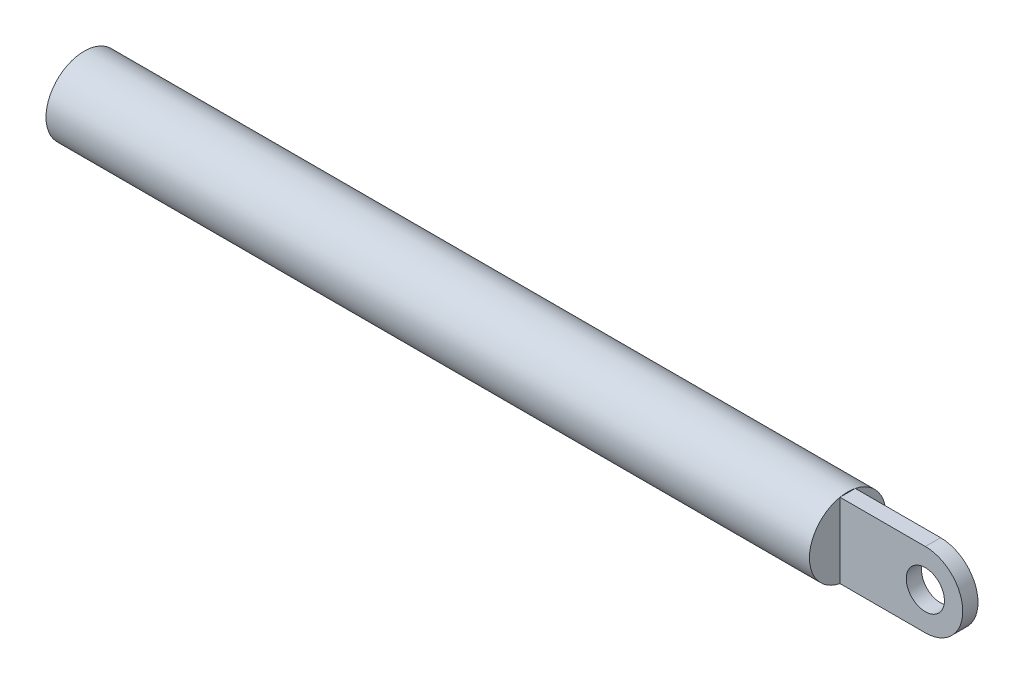
ISO-10303-21;
HEADER;
FILE_DESCRIPTION(('STEP AP214'),'2;1');
FILE_NAME('part.step','',(''),(''),'','','');
FILE_SCHEMA(('AUTOMOTIVE_DESIGN { 1 0 10303 214 1 1 1 1 }'));
ENDSEC;
DATA;
#1=APPLICATION_CONTEXT('core data for automotive mechanical design processes');
#2=APPLICATION_PROTOCOL_DEFINITION('international standard','automotive_design',2000,#1);
#3=PRODUCT_CONTEXT('',#1,'mechanical');
#4=PRODUCT('Part','Part','',(#3));
#5=PRODUCT_RELATED_PRODUCT_CATEGORY('part','',(#4));
#6=PRODUCT_DEFINITION_FORMATION('','',#4);
#7=PRODUCT_DEFINITION_CONTEXT('part definition',#1,'design');
#8=PRODUCT_DEFINITION('design','',#6,#7);
#9=PRODUCT_DEFINITION_SHAPE('','',#8);
#10=(LENGTH_UNIT() NAMED_UNIT(*) SI_UNIT(.MILLI.,.METRE.));
#11=(NAMED_UNIT(*) PLANE_ANGLE_UNIT() SI_UNIT($,.RADIAN.));
#12=(NAMED_UNIT(*) SI_UNIT($,.STERADIAN.) SOLID_ANGLE_UNIT());
#13=UNCERTAINTY_MEASURE_WITH_UNIT(LENGTH_MEASURE(1.E-05),#10,'distance_accuracy_value','');
#14=(GEOMETRIC_REPRESENTATION_CONTEXT(3) GLOBAL_UNCERTAINTY_ASSIGNED_CONTEXT((#13)) GLOBAL_UNIT_ASSIGNED_CONTEXT((#10,
#11,#12)) REPRESENTATION_CONTEXT('',''));
#15=CARTESIAN_POINT('',(0.,0.,0.));
#16=DIRECTION('',(0.,0.,1.));
#17=DIRECTION('',(1.,0.,0.));
#18=AXIS2_PLACEMENT_3D('',#15,#16,#17);
#19=CARTESIAN_POINT('',(46.1513157894737,8.93325735653892,0.));
#20=DIRECTION('',(0.,1.,0.));
#21=DIRECTION('',(0.,0.,1.));
#22=AXIS2_PLACEMENT_3D('',#19,#20,#21);
#23=PLANE('',#22);
#24=DIRECTION('',(0.,0.,1.));
#25=VECTOR('',#24,1.);
#26=CARTESIAN_POINT('',(37.3271390494249,8.93325735653892,-14.1858293307481));
#27=LINE('',#26,#25);
#28=CARTESIAN_POINT('',(37.3271390494249,8.93325735653892,-0.999999999999999));
#29=VERTEX_POINT('',#28);
#30=CARTESIAN_POINT('',(37.3271390494249,8.93325735653892,1.));
#31=VERTEX_POINT('',#30);
#32=EDGE_CURVE('E83',#29,#31,#27,.T.);
#33=ORIENTED_EDGE('',*,*,#32,.T.);
#34=DIRECTION('',(-1.,0.,0.));
#35=VECTOR('',#34,1.);
#36=CARTESIAN_POINT('',(46.1513157894737,8.93325735653892,1.00000000000003));
#37=LINE('',#36,#35);
#38=CARTESIAN_POINT('',(26.1513157894737,8.93325735653892,1.));
#39=VERTEX_POINT('',#38);
#40=EDGE_CURVE('E64',#31,#39,#37,.T.);
#41=ORIENTED_EDGE('',*,*,#40,.T.);
#42=DIRECTION('',(0.,0.,-1.));
#43=VECTOR('',#42,1.);
#44=CARTESIAN_POINT('',(26.1513157894737,8.93325735653892,0.));
#45=LINE('',#44,#43);
#46=CARTESIAN_POINT('',(26.1513157894737,8.93325735653892,-1.));
#47=VERTEX_POINT('',#46);
#48=EDGE_CURVE('E122',#39,#47,#45,.T.);
#49=ORIENTED_EDGE('',*,*,#48,.T.);
#50=DIRECTION('',(-1.,0.,0.));
#51=VECTOR('',#50,1.);
#52=CARTESIAN_POINT('',(46.1513157894737,8.93325735653892,-1.00000000000003));
#53=LINE('',#52,#51);
#54=EDGE_CURVE('E90',#29,#47,#53,.T.);
#55=ORIENTED_EDGE('',*,*,#54,.F.);
#56=EDGE_LOOP('',(#33,#41,#49,#55));
#57=FACE_BOUND('',#56,.T.);
#58=ADVANCED_FACE('F40',(#57),#23,.F.);
#59=CARTESIAN_POINT('',(46.1513157894737,18.7312163276716,0.));
#60=DIRECTION('',(0.,1.,0.));
#61=DIRECTION('',(0.,0.,1.));
#62=AXIS2_PLACEMENT_3D('',#59,#60,#61);
#63=PLANE('',#62);
#64=DIRECTION('',(-1.,0.,0.));
#65=VECTOR('',#64,1.);
#66=CARTESIAN_POINT('',(46.1513157894737,18.7312163276716,1.));
#67=LINE('',#66,#65);
#68=CARTESIAN_POINT('',(37.3271390494249,18.7312163276716,1.));
#69=VERTEX_POINT('',#68);
#70=CARTESIAN_POINT('',(26.1513157894737,18.7312163276716,1.00000000000001));
#71=VERTEX_POINT('',#70);
#72=EDGE_CURVE('E96',#69,#71,#67,.T.);
#73=ORIENTED_EDGE('',*,*,#72,.F.);
#74=DIRECTION('',(0.,0.,1.));
#75=VECTOR('',#74,1.);
#76=CARTESIAN_POINT('',(37.3271390494249,18.7312163276716,-14.1858293307481));
#77=LINE('',#76,#75);
#78=CARTESIAN_POINT('',(37.3271390494249,18.7312163276716,-0.999999999999999));
#79=VERTEX_POINT('',#78);
#80=EDGE_CURVE('E56',#79,#69,#77,.T.);
#81=ORIENTED_EDGE('',*,*,#80,.F.);
#82=DIRECTION('',(-1.,0.,0.));
#83=VECTOR('',#82,1.);
#84=CARTESIAN_POINT('',(46.1513157894737,18.7312163276716,-1.00000000000001));
#85=LINE('',#84,#83);
#86=CARTESIAN_POINT('',(26.1513157894737,18.7312163276716,-1.00000000000001));
#87=VERTEX_POINT('',#86);
#88=EDGE_CURVE('E98',#79,#87,#85,.T.);
#89=ORIENTED_EDGE('',*,*,#88,.T.);
#90=DIRECTION('',(0.,0.,-1.));
#91=VECTOR('',#90,1.);
#92=CARTESIAN_POINT('',(26.1513157894737,18.7312163276716,0.));
#93=LINE('',#92,#91);
#94=EDGE_CURVE('E100',#71,#87,#93,.T.);
#95=ORIENTED_EDGE('',*,*,#94,.F.);
#96=EDGE_LOOP('',(#73,#81,#89,#95));
#97=FACE_BOUND('',#96,.T.);
#98=ADVANCED_FACE('F141',(#97),#63,.T.);
#99=CARTESIAN_POINT('',(26.1513157894737,18.8322368421053,0.));
#100=DIRECTION('',(-1.,0.,0.));
#101=DIRECTION('',(0.,0.,1.));
#102=AXIS2_PLACEMENT_3D('',#99,#100,#101);
#103=PLANE('',#102);
#104=ORIENTED_EDGE('',*,*,#48,.F.);
#105=CARTESIAN_POINT('',(26.1513157894737,13.8322368421053,0.));
#106=DIRECTION('',(-1.,0.,0.));
#107=DIRECTION('',(0.,0.,1.));
#108=AXIS2_PLACEMENT_3D('',#105,#106,#107);
#109=CIRCLE('',#108,5.);
#110=EDGE_CURVE('E110',#47,#39,#109,.T.);
#111=ORIENTED_EDGE('',*,*,#110,.F.);
#112=EDGE_LOOP('',(#104,#111));
#113=FACE_BOUND('',#112,.T.);
#114=ADVANCED_FACE('F138',(#113),#103,.F.);
#115=EDGE_CURVE('E49',#39,#71,#109,.T.);
#116=ORIENTED_EDGE('',*,*,#115,.F.);
#117=DIRECTION('',(0.,1.,0.));
#118=VECTOR('',#117,1.);
#119=CARTESIAN_POINT('',(26.1513157894737,0.,1.));
#120=LINE('',#119,#118);
#121=EDGE_CURVE('E95',#39,#71,#120,.T.);
#122=ORIENTED_EDGE('',*,*,#121,.T.);
#123=EDGE_LOOP('',(#116,#122));
#124=FACE_BOUND('',#123,.T.);
#125=ADVANCED_FACE('F140',(#124),#103,.F.);
#126=DIRECTION('',(0.,1.,0.));
#127=VECTOR('',#126,1.);
#128=CARTESIAN_POINT('',(26.1513157894737,0.,-0.999999999999999));
#129=LINE('',#128,#127);
#130=EDGE_CURVE('E124',#47,#87,#129,.T.);
#131=ORIENTED_EDGE('',*,*,#130,.F.);
#132=EDGE_CURVE('E48',#87,#47,#109,.T.);
#133=ORIENTED_EDGE('',*,*,#132,.F.);
#134=EDGE_LOOP('',(#131,#133));
#135=FACE_BOUND('',#134,.T.);
#136=ADVANCED_FACE('F137',(#135),#103,.F.);
#137=EDGE_CURVE('E11',#71,#87,#109,.T.);
#138=ORIENTED_EDGE('',*,*,#137,.F.);
#139=ORIENTED_EDGE('',*,*,#94,.T.);
#140=EDGE_LOOP('',(#138,#139));
#141=FACE_BOUND('',#140,.T.);
#142=ADVANCED_FACE('F42',(#141),#103,.F.);
#143=CARTESIAN_POINT('',(-73.8486842105263,13.8322368421053,0.));
#144=DIRECTION('',(-1.,0.,0.));
#145=DIRECTION('',(0.,0.,1.));
#146=AXIS2_PLACEMENT_3D('',#143,#144,#145);
#147=CYLINDRICAL_SURFACE('',#146,5.);
#148=CARTESIAN_POINT('',(-73.8486842105263,13.8322368421053,0.));
#149=DIRECTION('',(-1.,0.,0.));
#150=DIRECTION('',(0.,0.,1.));
#151=AXIS2_PLACEMENT_3D('',#148,#149,#150);
#152=CIRCLE('',#151,5.);
#153=CARTESIAN_POINT('',(-73.8486842105263,13.8322368421053,5.));
#154=VERTEX_POINT('',#153);
#155=EDGE_CURVE('E105',#154,#154,#152,.T.);
#156=ORIENTED_EDGE('',*,*,#155,.F.);
#157=EDGE_LOOP('',(#156));
#158=FACE_BOUND('',#157,.T.);
#159=ORIENTED_EDGE('',*,*,#137,.T.);
#160=ORIENTED_EDGE('',*,*,#132,.T.);
#161=ORIENTED_EDGE('',*,*,#110,.T.);
#162=ORIENTED_EDGE('',*,*,#115,.T.);
#163=EDGE_LOOP('',(#159,#160,#161,#162));
#164=FACE_BOUND('',#163,.T.);
#165=ADVANCED_FACE('F118',(#158,#164),#147,.T.);
#166=CARTESIAN_POINT('',(-73.8486842105263,18.8322368421053,0.));
#167=DIRECTION('',(1.,0.,0.));
#168=DIRECTION('',(0.,0.,-1.));
#169=AXIS2_PLACEMENT_3D('',#166,#167,#168);
#170=PLANE('',#169);
#171=ORIENTED_EDGE('',*,*,#155,.T.);
#172=EDGE_LOOP('',(#171));
#173=FACE_BOUND('',#172,.T.);
#174=ADVANCED_FACE('F155',(#173),#170,.F.);
#175=CARTESIAN_POINT('',(46.1513157894737,0.,-0.999999999999999));
#176=DIRECTION('',(0.,0.,1.));
#177=DIRECTION('',(0.,-1.,0.));
#178=AXIS2_PLACEMENT_3D('',#175,#176,#177);
#179=PLANE('',#178);
#180=CARTESIAN_POINT('',(37.3271390494249,13.8322368421053,-1.));
#181=DIRECTION('',(0.,0.,1.));
#182=DIRECTION('',(0.,-1.,0.));
#183=AXIS2_PLACEMENT_3D('',#180,#181,#182);
#184=CIRCLE('',#183,2.5);
#185=CARTESIAN_POINT('',(37.3271390494249,11.3322368421053,-1.));
#186=VERTEX_POINT('',#185);
#187=EDGE_CURVE('E87',#186,#186,#184,.F.);
#188=ORIENTED_EDGE('',*,*,#187,.F.);
#189=EDGE_LOOP('',(#188));
#190=FACE_BOUND('',#189,.T.);
#191=ORIENTED_EDGE('',*,*,#88,.F.);
#192=CARTESIAN_POINT('',(37.3271390494249,13.8322368421053,-0.999999999999999));
#193=DIRECTION('',(0.,0.,1.));
#194=DIRECTION('',(0.,-1.,0.));
#195=AXIS2_PLACEMENT_3D('',#192,#193,#194);
#196=CIRCLE('',#195,4.89897948556635);
#197=EDGE_CURVE('E125',#29,#79,#196,.T.);
#198=ORIENTED_EDGE('',*,*,#197,.F.);
#199=ORIENTED_EDGE('',*,*,#54,.T.);
#200=ORIENTED_EDGE('',*,*,#130,.T.);
#201=EDGE_LOOP('',(#191,#198,#199,#200));
#202=FACE_BOUND('',#201,.T.);
#203=ADVANCED_FACE('F136',(#190,#202),#179,.F.);
#204=CARTESIAN_POINT('',(46.1513157894737,0.,1.));
#205=DIRECTION('',(0.,0.,1.));
#206=DIRECTION('',(0.,-1.,0.));
#207=AXIS2_PLACEMENT_3D('',#204,#205,#206);
#208=PLANE('',#207);
#209=CARTESIAN_POINT('',(37.3271390494249,13.8322368421053,1.));
#210=DIRECTION('',(0.,0.,1.));
#211=DIRECTION('',(1.,0.,0.));
#212=AXIS2_PLACEMENT_3D('',#209,#210,#211);
#213=CIRCLE('',#212,2.5);
#214=CARTESIAN_POINT('',(39.8271390494249,13.8322368421053,1.));
#215=VERTEX_POINT('',#214);
#216=EDGE_CURVE('E244',#215,#215,#213,.T.);
#217=ORIENTED_EDGE('',*,*,#216,.F.);
#218=EDGE_LOOP('',(#217));
#219=FACE_BOUND('',#218,.T.);
#220=CARTESIAN_POINT('',(37.3271390494249,13.8322368421053,1.));
#221=DIRECTION('',(0.,0.,-1.));
#222=DIRECTION('',(-1.,0.,0.));
#223=AXIS2_PLACEMENT_3D('',#220,#221,#222);
#224=CIRCLE('',#223,4.89897948556635);
#225=EDGE_CURVE('E81',#69,#31,#224,.T.);
#226=ORIENTED_EDGE('',*,*,#225,.F.);
#227=ORIENTED_EDGE('',*,*,#72,.T.);
#228=ORIENTED_EDGE('',*,*,#121,.F.);
#229=ORIENTED_EDGE('',*,*,#40,.F.);
#230=EDGE_LOOP('',(#226,#227,#228,#229));
#231=FACE_BOUND('',#230,.T.);
#232=ADVANCED_FACE('F93',(#219,#231),#208,.T.);
#233=CARTESIAN_POINT('',(37.3271390494249,13.8322368421053,-14.1858293307481));
#234=DIRECTION('',(0.,0.,1.));
#235=DIRECTION('',(1.,0.,0.));
#236=AXIS2_PLACEMENT_3D('',#233,#234,#235);
#237=CYLINDRICAL_SURFACE('',#236,4.89897948556635);
#238=ORIENTED_EDGE('',*,*,#197,.T.);
#239=ORIENTED_EDGE('',*,*,#80,.T.);
#240=ORIENTED_EDGE('',*,*,#225,.T.);
#241=ORIENTED_EDGE('',*,*,#32,.F.);
#242=EDGE_LOOP('',(#238,#239,#240,#241));
#243=FACE_BOUND('',#242,.T.);
#244=ADVANCED_FACE('F82',(#243),#237,.T.);
#245=CARTESIAN_POINT('',(37.3271390494249,13.8322368421053,-8.07106781186548));
#246=DIRECTION('',(0.,0.,1.));
#247=DIRECTION('',(1.,0.,0.));
#248=AXIS2_PLACEMENT_3D('',#245,#246,#247);
#249=CYLINDRICAL_SURFACE('',#248,2.5);
#250=ORIENTED_EDGE('',*,*,#187,.T.);
#251=EDGE_LOOP('',(#250));
#252=FACE_BOUND('',#251,.T.);
#253=ORIENTED_EDGE('',*,*,#216,.T.);
#254=EDGE_LOOP('',(#253));
#255=FACE_BOUND('',#254,.T.);
#256=ADVANCED_FACE('F188',(#252,#255),#249,.F.);
#257=CLOSED_SHELL('',(#58,#98,#114,#125,#136,#142,#165,#174,#203,#232,#244,#256));
#258=MANIFOLD_SOLID_BREP('B2',#257);
#259=ADVANCED_BREP_SHAPE_REPRESENTATION('',(#18,#258),#14);
#260=SHAPE_DEFINITION_REPRESENTATION(#9,#259);
ENDSEC;
END-ISO-10303-21;
